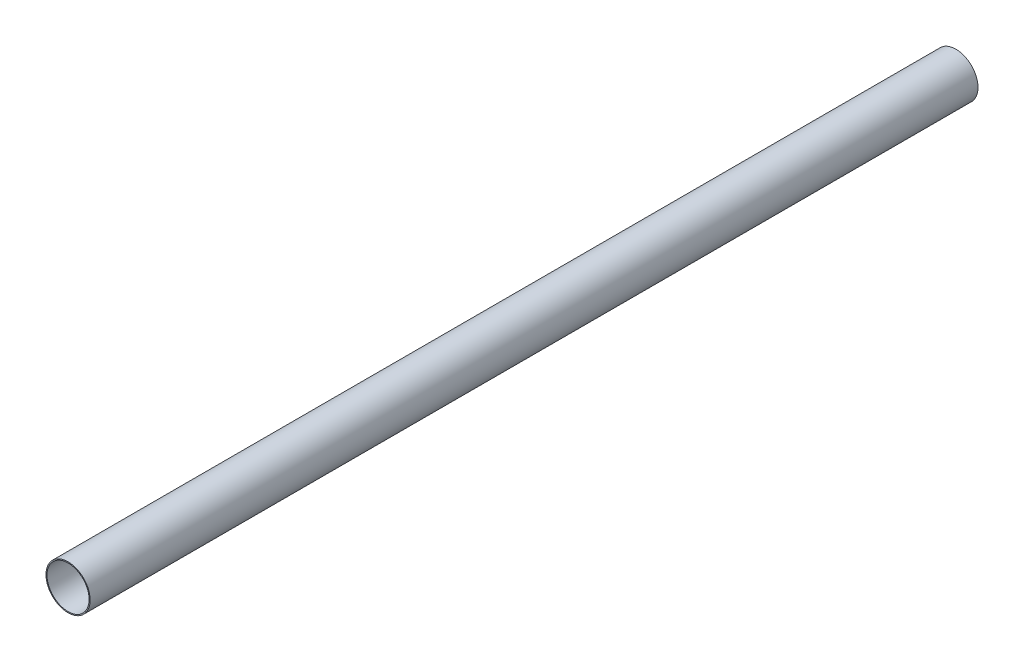
ISO-10303-21;
HEADER;
FILE_DESCRIPTION(('STEP AP214'),'2;1');
FILE_NAME('part.step','',(''),(''),'','','');
FILE_SCHEMA(('AUTOMOTIVE_DESIGN { 1 0 10303 214 1 1 1 1 }'));
ENDSEC;
DATA;
#1=APPLICATION_CONTEXT('core data for automotive mechanical design processes');
#2=APPLICATION_PROTOCOL_DEFINITION('international standard','automotive_design',2000,#1);
#3=PRODUCT_CONTEXT('',#1,'mechanical');
#4=PRODUCT('Part','Part','',(#3));
#5=PRODUCT_RELATED_PRODUCT_CATEGORY('part','',(#4));
#6=PRODUCT_DEFINITION_FORMATION('','',#4);
#7=PRODUCT_DEFINITION_CONTEXT('part definition',#1,'design');
#8=PRODUCT_DEFINITION('design','',#6,#7);
#9=PRODUCT_DEFINITION_SHAPE('','',#8);
#10=(LENGTH_UNIT() NAMED_UNIT(*) SI_UNIT(.MILLI.,.METRE.));
#11=(NAMED_UNIT(*) PLANE_ANGLE_UNIT() SI_UNIT($,.RADIAN.));
#12=(NAMED_UNIT(*) SI_UNIT($,.STERADIAN.) SOLID_ANGLE_UNIT());
#13=UNCERTAINTY_MEASURE_WITH_UNIT(LENGTH_MEASURE(1.E-05),#10,'distance_accuracy_value','');
#14=(GEOMETRIC_REPRESENTATION_CONTEXT(3) GLOBAL_UNCERTAINTY_ASSIGNED_CONTEXT((#13)) GLOBAL_UNIT_ASSIGNED_CONTEXT((#10,
#11,#12)) REPRESENTATION_CONTEXT('',''));
#15=CARTESIAN_POINT('',(0.,0.,0.));
#16=DIRECTION('',(0.,0.,1.));
#17=DIRECTION('',(1.,0.,0.));
#18=AXIS2_PLACEMENT_3D('',#15,#16,#17);
#19=CARTESIAN_POINT('',(0.,0.,5486.4));
#20=DIRECTION('',(0.,0.,1.));
#21=DIRECTION('',(1.,0.,0.));
#22=AXIS2_PLACEMENT_3D('',#19,#20,#21);
#23=PLANE('',#22);
#24=CARTESIAN_POINT('',(0.,0.,5486.4));
#25=DIRECTION('',(0.,0.,1.));
#26=DIRECTION('',(1.,0.,0.));
#27=AXIS2_PLACEMENT_3D('',#24,#25,#26);
#28=CIRCLE('',#27,136.525);
#29=CARTESIAN_POINT('',(136.525,0.,5486.4));
#30=VERTEX_POINT('',#29);
#31=EDGE_CURVE('E10',#30,#30,#28,.T.);
#32=ORIENTED_EDGE('',*,*,#31,.T.);
#33=EDGE_LOOP('',(#32));
#34=FACE_BOUND('',#33,.T.);
#35=CARTESIAN_POINT('',(0.,0.,5486.4));
#36=DIRECTION('',(0.,0.,1.));
#37=DIRECTION('',(1.,0.,0.));
#38=AXIS2_PLACEMENT_3D('',#35,#36,#37);
#39=CIRCLE('',#38,130.175);
#40=CARTESIAN_POINT('',(130.175,0.,5486.4));
#41=VERTEX_POINT('',#40);
#42=EDGE_CURVE('E39',#41,#41,#39,.T.);
#43=ORIENTED_EDGE('',*,*,#42,.F.);
#44=EDGE_LOOP('',(#43));
#45=FACE_BOUND('',#44,.T.);
#46=ADVANCED_FACE('F28',(#34,#45),#23,.T.);
#47=CARTESIAN_POINT('',(0.,0.,0.));
#48=DIRECTION('',(0.,0.,1.));
#49=DIRECTION('',(1.,0.,0.));
#50=AXIS2_PLACEMENT_3D('',#47,#48,#49);
#51=PLANE('',#50);
#52=CARTESIAN_POINT('',(0.,0.,0.));
#53=DIRECTION('',(0.,0.,1.));
#54=DIRECTION('',(1.,0.,0.));
#55=AXIS2_PLACEMENT_3D('',#52,#53,#54);
#56=CIRCLE('',#55,136.525);
#57=CARTESIAN_POINT('',(136.525,0.,0.));
#58=VERTEX_POINT('',#57);
#59=EDGE_CURVE('E32',#58,#58,#56,.T.);
#60=ORIENTED_EDGE('',*,*,#59,.F.);
#61=EDGE_LOOP('',(#60));
#62=FACE_BOUND('',#61,.T.);
#63=CARTESIAN_POINT('',(0.,0.,0.));
#64=DIRECTION('',(0.,0.,1.));
#65=DIRECTION('',(1.,0.,0.));
#66=AXIS2_PLACEMENT_3D('',#63,#64,#65);
#67=CIRCLE('',#66,130.175);
#68=CARTESIAN_POINT('',(130.175,0.,0.));
#69=VERTEX_POINT('',#68);
#70=EDGE_CURVE('E41',#69,#69,#67,.T.);
#71=ORIENTED_EDGE('',*,*,#70,.T.);
#72=EDGE_LOOP('',(#71));
#73=FACE_BOUND('',#72,.T.);
#74=ADVANCED_FACE('F51',(#62,#73),#51,.F.);
#75=CARTESIAN_POINT('',(0.,0.,5486.4));
#76=DIRECTION('',(0.,0.,-1.));
#77=DIRECTION('',(-1.,0.,0.));
#78=AXIS2_PLACEMENT_3D('',#75,#76,#77);
#79=CYLINDRICAL_SURFACE('',#78,136.525);
#80=ORIENTED_EDGE('',*,*,#31,.F.);
#81=EDGE_LOOP('',(#80));
#82=FACE_BOUND('',#81,.T.);
#83=ORIENTED_EDGE('',*,*,#59,.T.);
#84=EDGE_LOOP('',(#83));
#85=FACE_BOUND('',#84,.T.);
#86=ADVANCED_FACE('F30',(#82,#85),#79,.T.);
#87=CARTESIAN_POINT('',(0.,0.,5486.4));
#88=DIRECTION('',(0.,0.,-1.));
#89=DIRECTION('',(-1.,0.,0.));
#90=AXIS2_PLACEMENT_3D('',#87,#88,#89);
#91=CYLINDRICAL_SURFACE('',#90,130.175);
#92=ORIENTED_EDGE('',*,*,#42,.T.);
#93=EDGE_LOOP('',(#92));
#94=FACE_BOUND('',#93,.T.);
#95=ORIENTED_EDGE('',*,*,#70,.F.);
#96=EDGE_LOOP('',(#95));
#97=FACE_BOUND('',#96,.T.);
#98=ADVANCED_FACE('F47',(#94,#97),#91,.F.);
#99=CLOSED_SHELL('',(#46,#74,#86,#98));
#100=MANIFOLD_SOLID_BREP('B2',#99);
#101=ADVANCED_BREP_SHAPE_REPRESENTATION('',(#18,#100),#14);
#102=SHAPE_DEFINITION_REPRESENTATION(#9,#101);
ENDSEC;
END-ISO-10303-21;
